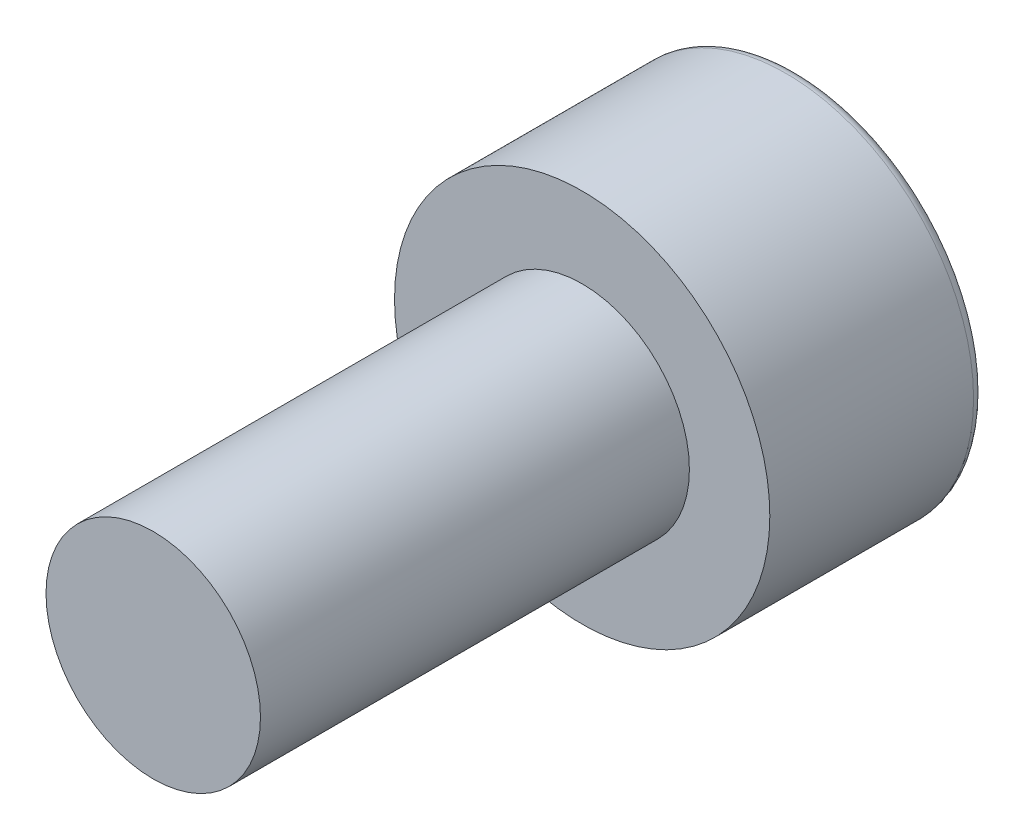
ISO-10303-21;
HEADER;
FILE_DESCRIPTION(('STEP AP214'),'2;1');
FILE_NAME('part.step','',(''),(''),'','','');
FILE_SCHEMA(('AUTOMOTIVE_DESIGN { 1 0 10303 214 1 1 1 1 }'));
ENDSEC;
DATA;
#1=APPLICATION_CONTEXT('core data for automotive mechanical design processes');
#2=APPLICATION_PROTOCOL_DEFINITION('international standard','automotive_design',2000,#1);
#3=PRODUCT_CONTEXT('',#1,'mechanical');
#4=PRODUCT('Part','Part','',(#3));
#5=PRODUCT_RELATED_PRODUCT_CATEGORY('part','',(#4));
#6=PRODUCT_DEFINITION_FORMATION('','',#4);
#7=PRODUCT_DEFINITION_CONTEXT('part definition',#1,'design');
#8=PRODUCT_DEFINITION('design','',#6,#7);
#9=PRODUCT_DEFINITION_SHAPE('','',#8);
#10=(LENGTH_UNIT() NAMED_UNIT(*) SI_UNIT(.MILLI.,.METRE.));
#11=(NAMED_UNIT(*) PLANE_ANGLE_UNIT() SI_UNIT($,.RADIAN.));
#12=(NAMED_UNIT(*) SI_UNIT($,.STERADIAN.) SOLID_ANGLE_UNIT());
#13=UNCERTAINTY_MEASURE_WITH_UNIT(LENGTH_MEASURE(1.E-05),#10,'distance_accuracy_value','');
#14=(GEOMETRIC_REPRESENTATION_CONTEXT(3) GLOBAL_UNCERTAINTY_ASSIGNED_CONTEXT((#13)) GLOBAL_UNIT_ASSIGNED_CONTEXT((#10,
#11,#12)) REPRESENTATION_CONTEXT('',''));
#15=CARTESIAN_POINT('',(0.,0.,0.));
#16=DIRECTION('',(0.,0.,1.));
#17=DIRECTION('',(1.,0.,0.));
#18=AXIS2_PLACEMENT_3D('',#15,#16,#17);
#19=CARTESIAN_POINT('',(0.,0.,8.));
#20=DIRECTION('',(0.,0.,-1.));
#21=DIRECTION('',(-1.,0.,0.));
#22=AXIS2_PLACEMENT_3D('',#19,#20,#21);
#23=CYLINDRICAL_SURFACE('',#22,2.);
#24=CARTESIAN_POINT('',(0.,0.,8.));
#25=DIRECTION('',(0.,0.,1.));
#26=DIRECTION('',(1.,0.,0.));
#27=AXIS2_PLACEMENT_3D('',#24,#25,#26);
#28=CIRCLE('',#27,2.);
#29=CARTESIAN_POINT('',(2.,0.,8.));
#30=VERTEX_POINT('',#29);
#31=EDGE_CURVE('E154',#30,#30,#28,.T.);
#32=ORIENTED_EDGE('',*,*,#31,.F.);
#33=EDGE_LOOP('',(#32));
#34=FACE_BOUND('',#33,.T.);
#35=CARTESIAN_POINT('',(0.,0.,0.));
#36=DIRECTION('',(0.,0.,1.));
#37=DIRECTION('',(1.,0.,0.));
#38=AXIS2_PLACEMENT_3D('',#35,#36,#37);
#39=CIRCLE('',#38,2.);
#40=CARTESIAN_POINT('',(2.,0.,0.));
#41=VERTEX_POINT('',#40);
#42=EDGE_CURVE('E151',#41,#41,#39,.T.);
#43=ORIENTED_EDGE('',*,*,#42,.T.);
#44=EDGE_LOOP('',(#43));
#45=FACE_BOUND('',#44,.T.);
#46=ADVANCED_FACE('F41',(#34,#45),#23,.T.);
#47=CARTESIAN_POINT('',(0.,0.,8.));
#48=DIRECTION('',(0.,0.,1.));
#49=DIRECTION('',(1.,0.,0.));
#50=AXIS2_PLACEMENT_3D('',#47,#48,#49);
#51=PLANE('',#50);
#52=ORIENTED_EDGE('',*,*,#31,.T.);
#53=EDGE_LOOP('',(#52));
#54=FACE_BOUND('',#53,.T.);
#55=ADVANCED_FACE('F172',(#54),#51,.T.);
#56=CARTESIAN_POINT('',(0.,0.,0.));
#57=DIRECTION('',(0.,0.,1.));
#58=DIRECTION('',(1.,0.,0.));
#59=AXIS2_PLACEMENT_3D('',#56,#57,#58);
#60=PLANE('',#59);
#61=CARTESIAN_POINT('',(0.,0.,0.));
#62=DIRECTION('',(0.,0.,1.));
#63=DIRECTION('',(1.,0.,0.));
#64=AXIS2_PLACEMENT_3D('',#61,#62,#63);
#65=CIRCLE('',#64,3.5);
#66=CARTESIAN_POINT('',(3.5,0.,0.));
#67=VERTEX_POINT('',#66);
#68=EDGE_CURVE('E143',#67,#67,#65,.T.);
#69=ORIENTED_EDGE('',*,*,#68,.T.);
#70=EDGE_LOOP('',(#69));
#71=FACE_BOUND('',#70,.T.);
#72=ORIENTED_EDGE('',*,*,#42,.F.);
#73=EDGE_LOOP('',(#72));
#74=FACE_BOUND('',#73,.T.);
#75=ADVANCED_FACE('F177',(#71,#74),#60,.T.);
#76=CARTESIAN_POINT('',(0.,0.,-4.));
#77=DIRECTION('',(0.,0.,1.));
#78=DIRECTION('',(1.,0.,0.));
#79=AXIS2_PLACEMENT_3D('',#76,#77,#78);
#80=CYLINDRICAL_SURFACE('',#79,3.5);
#81=CARTESIAN_POINT('',(0.,0.,-3.8));
#82=DIRECTION('',(0.,0.,1.));
#83=DIRECTION('',(1.,0.,0.));
#84=AXIS2_PLACEMENT_3D('',#81,#82,#83);
#85=CIRCLE('',#84,3.5);
#86=CARTESIAN_POINT('',(3.5,0.,-3.8));
#87=VERTEX_POINT('',#86);
#88=EDGE_CURVE('E49',#87,#87,#85,.T.);
#89=ORIENTED_EDGE('',*,*,#88,.T.);
#90=EDGE_LOOP('',(#89));
#91=FACE_BOUND('',#90,.T.);
#92=ORIENTED_EDGE('',*,*,#68,.F.);
#93=EDGE_LOOP('',(#92));
#94=FACE_BOUND('',#93,.T.);
#95=ADVANCED_FACE('F159',(#91,#94),#80,.T.);
#96=CARTESIAN_POINT('',(0.,0.,-4.));
#97=DIRECTION('',(0.,0.,1.));
#98=DIRECTION('',(1.,0.,0.));
#99=AXIS2_PLACEMENT_3D('',#96,#97,#98);
#100=PLANE('',#99);
#101=CARTESIAN_POINT('',(0.,0.,-4.));
#102=DIRECTION('',(0.,0.,1.));
#103=DIRECTION('',(1.,0.,0.));
#104=AXIS2_PLACEMENT_3D('',#101,#102,#103);
#105=CIRCLE('',#104,3.3);
#106=CARTESIAN_POINT('',(3.3,0.,-4.));
#107=VERTEX_POINT('',#106);
#108=EDGE_CURVE('E11',#107,#107,#105,.F.);
#109=ORIENTED_EDGE('',*,*,#108,.T.);
#110=EDGE_LOOP('',(#109));
#111=FACE_BOUND('',#110,.T.);
#112=DIRECTION('',(0.868434161422195,-0.495804505097451,0.));
#113=VECTOR('',#112,1.);
#114=CARTESIAN_POINT('',(0.,1.72,-4.));
#115=LINE('',#114,#113);
#116=CARTESIAN_POINT('',(0.,1.72,-4.));
#117=VERTEX_POINT('',#116);
#118=CARTESIAN_POINT('',(1.5,0.863623327267273,-4.));
#119=VERTEX_POINT('',#118);
#120=EDGE_CURVE('E130',#117,#119,#115,.T.);
#121=ORIENTED_EDGE('',*,*,#120,.F.);
#122=DIRECTION('',(0.868434161422195,0.495804505097451,0.));
#123=VECTOR('',#122,1.);
#124=CARTESIAN_POINT('',(-1.5,0.863623327267273,-4.));
#125=LINE('',#124,#123);
#126=CARTESIAN_POINT('',(-1.5,0.863623327267273,-4.));
#127=VERTEX_POINT('',#126);
#128=EDGE_CURVE('E56',#127,#117,#125,.T.);
#129=ORIENTED_EDGE('',*,*,#128,.F.);
#130=DIRECTION('',(0.,1.,0.));
#131=VECTOR('',#130,1.);
#132=CARTESIAN_POINT('',(-1.5,-0.863623327267273,-4.));
#133=LINE('',#132,#131);
#134=CARTESIAN_POINT('',(-1.5,-0.863623327267273,-4.));
#135=VERTEX_POINT('',#134);
#136=EDGE_CURVE('E139',#135,#127,#133,.T.);
#137=ORIENTED_EDGE('',*,*,#136,.F.);
#138=DIRECTION('',(-0.868434161422196,0.495804505097451,0.));
#139=VECTOR('',#138,1.);
#140=CARTESIAN_POINT('',(0.,-1.72,-4.));
#141=LINE('',#140,#139);
#142=CARTESIAN_POINT('',(0.,-1.72,-4.));
#143=VERTEX_POINT('',#142);
#144=EDGE_CURVE('E137',#143,#135,#141,.T.);
#145=ORIENTED_EDGE('',*,*,#144,.F.);
#146=DIRECTION('',(-0.868434161422196,-0.495804505097451,0.));
#147=VECTOR('',#146,1.);
#148=CARTESIAN_POINT('',(1.5,-0.863623327267272,-4.));
#149=LINE('',#148,#147);
#150=CARTESIAN_POINT('',(1.5,-0.863623327267272,-4.));
#151=VERTEX_POINT('',#150);
#152=EDGE_CURVE('E104',#151,#143,#149,.T.);
#153=ORIENTED_EDGE('',*,*,#152,.F.);
#154=DIRECTION('',(0.,-1.,0.));
#155=VECTOR('',#154,1.);
#156=CARTESIAN_POINT('',(1.5,0.863623327267273,-4.));
#157=LINE('',#156,#155);
#158=EDGE_CURVE('E133',#119,#151,#157,.T.);
#159=ORIENTED_EDGE('',*,*,#158,.F.);
#160=EDGE_LOOP('',(#121,#129,#137,#145,#153,#159));
#161=FACE_BOUND('',#160,.T.);
#162=ADVANCED_FACE('F185',(#111,#161),#100,.F.);
#163=CARTESIAN_POINT('',(-1.5,0.863623327267273,-2.));
#164=DIRECTION('',(-0.495804505097451,0.868434161422196,0.));
#165=DIRECTION('',(-0.868434161422195,-0.495804505097451,0.));
#166=AXIS2_PLACEMENT_3D('',#163,#164,#165);
#167=PLANE('',#166);
#168=ORIENTED_EDGE('',*,*,#128,.T.);
#169=DIRECTION('',(0.,0.,-1.));
#170=VECTOR('',#169,1.);
#171=CARTESIAN_POINT('',(0.,1.72,-2.));
#172=LINE('',#171,#170);
#173=CARTESIAN_POINT('',(0.,1.72,-2.));
#174=VERTEX_POINT('',#173);
#175=EDGE_CURVE('E86',#174,#117,#172,.T.);
#176=ORIENTED_EDGE('',*,*,#175,.F.);
#177=DIRECTION('',(0.868434161422195,0.495804505097451,0.));
#178=VECTOR('',#177,1.);
#179=CARTESIAN_POINT('',(-1.5,0.863623327267273,-2.));
#180=LINE('',#179,#178);
#181=CARTESIAN_POINT('',(-1.5,0.863623327267273,-2.));
#182=VERTEX_POINT('',#181);
#183=EDGE_CURVE('E141',#182,#174,#180,.T.);
#184=ORIENTED_EDGE('',*,*,#183,.F.);
#185=DIRECTION('',(0.,0.,-1.));
#186=VECTOR('',#185,1.);
#187=CARTESIAN_POINT('',(-1.5,0.863623327267273,-2.));
#188=LINE('',#187,#186);
#189=EDGE_CURVE('E64',#182,#127,#188,.T.);
#190=ORIENTED_EDGE('',*,*,#189,.T.);
#191=EDGE_LOOP('',(#168,#176,#184,#190));
#192=FACE_BOUND('',#191,.T.);
#193=ADVANCED_FACE('F190',(#192),#167,.F.);
#194=CARTESIAN_POINT('',(-1.5,-0.863623327267273,-2.));
#195=DIRECTION('',(-1.,0.,0.));
#196=DIRECTION('',(0.,0.,1.));
#197=AXIS2_PLACEMENT_3D('',#194,#195,#196);
#198=PLANE('',#197);
#199=ORIENTED_EDGE('',*,*,#136,.T.);
#200=ORIENTED_EDGE('',*,*,#189,.F.);
#201=DIRECTION('',(0.,1.,0.));
#202=VECTOR('',#201,1.);
#203=CARTESIAN_POINT('',(-1.5,-0.863623327267273,-2.));
#204=LINE('',#203,#202);
#205=CARTESIAN_POINT('',(-1.5,-0.863623327267273,-2.));
#206=VERTEX_POINT('',#205);
#207=EDGE_CURVE('E116',#206,#182,#204,.T.);
#208=ORIENTED_EDGE('',*,*,#207,.F.);
#209=DIRECTION('',(0.,0.,-1.));
#210=VECTOR('',#209,1.);
#211=CARTESIAN_POINT('',(-1.5,-0.863623327267273,-2.));
#212=LINE('',#211,#210);
#213=EDGE_CURVE('E108',#206,#135,#212,.T.);
#214=ORIENTED_EDGE('',*,*,#213,.T.);
#215=EDGE_LOOP('',(#199,#200,#208,#214));
#216=FACE_BOUND('',#215,.T.);
#217=ADVANCED_FACE('F194',(#216),#198,.F.);
#218=CARTESIAN_POINT('',(0.,-1.72,-2.));
#219=DIRECTION('',(-0.495804505097451,-0.868434161422196,0.));
#220=DIRECTION('',(0.868434161422196,-0.495804505097451,0.));
#221=AXIS2_PLACEMENT_3D('',#218,#219,#220);
#222=PLANE('',#221);
#223=ORIENTED_EDGE('',*,*,#144,.T.);
#224=ORIENTED_EDGE('',*,*,#213,.F.);
#225=DIRECTION('',(-0.868434161422196,0.495804505097451,0.));
#226=VECTOR('',#225,1.);
#227=CARTESIAN_POINT('',(0.,-1.72,-2.));
#228=LINE('',#227,#226);
#229=CARTESIAN_POINT('',(0.,-1.72,-2.));
#230=VERTEX_POINT('',#229);
#231=EDGE_CURVE('E112',#230,#206,#228,.T.);
#232=ORIENTED_EDGE('',*,*,#231,.F.);
#233=DIRECTION('',(0.,0.,-1.));
#234=VECTOR('',#233,1.);
#235=CARTESIAN_POINT('',(0.,-1.72,-2.));
#236=LINE('',#235,#234);
#237=EDGE_CURVE('E97',#230,#143,#236,.T.);
#238=ORIENTED_EDGE('',*,*,#237,.T.);
#239=EDGE_LOOP('',(#223,#224,#232,#238));
#240=FACE_BOUND('',#239,.T.);
#241=ADVANCED_FACE('F113',(#240),#222,.F.);
#242=CARTESIAN_POINT('',(1.5,-0.863623327267272,-2.));
#243=DIRECTION('',(0.495804505097451,-0.868434161422196,0.));
#244=DIRECTION('',(0.868434161422196,0.495804505097451,0.));
#245=AXIS2_PLACEMENT_3D('',#242,#243,#244);
#246=PLANE('',#245);
#247=ORIENTED_EDGE('',*,*,#152,.T.);
#248=ORIENTED_EDGE('',*,*,#237,.F.);
#249=DIRECTION('',(-0.868434161422196,-0.495804505097451,0.));
#250=VECTOR('',#249,1.);
#251=CARTESIAN_POINT('',(1.5,-0.863623327267272,-2.));
#252=LINE('',#251,#250);
#253=CARTESIAN_POINT('',(1.5,-0.863623327267272,-2.));
#254=VERTEX_POINT('',#253);
#255=EDGE_CURVE('E101',#254,#230,#252,.T.);
#256=ORIENTED_EDGE('',*,*,#255,.F.);
#257=DIRECTION('',(0.,0.,-1.));
#258=VECTOR('',#257,1.);
#259=CARTESIAN_POINT('',(1.5,-0.863623327267272,-2.));
#260=LINE('',#259,#258);
#261=EDGE_CURVE('E109',#254,#151,#260,.T.);
#262=ORIENTED_EDGE('',*,*,#261,.T.);
#263=EDGE_LOOP('',(#247,#248,#256,#262));
#264=FACE_BOUND('',#263,.T.);
#265=ADVANCED_FACE('F99',(#264),#246,.F.);
#266=CARTESIAN_POINT('',(1.5,0.863623327267273,-2.));
#267=DIRECTION('',(1.,0.,0.));
#268=DIRECTION('',(0.,0.,-1.));
#269=AXIS2_PLACEMENT_3D('',#266,#267,#268);
#270=PLANE('',#269);
#271=ORIENTED_EDGE('',*,*,#158,.T.);
#272=ORIENTED_EDGE('',*,*,#261,.F.);
#273=DIRECTION('',(0.,-1.,0.));
#274=VECTOR('',#273,1.);
#275=CARTESIAN_POINT('',(1.5,0.863623327267273,-2.));
#276=LINE('',#275,#274);
#277=CARTESIAN_POINT('',(1.5,0.863623327267273,-2.));
#278=VERTEX_POINT('',#277);
#279=EDGE_CURVE('E122',#278,#254,#276,.T.);
#280=ORIENTED_EDGE('',*,*,#279,.F.);
#281=DIRECTION('',(0.,0.,-1.));
#282=VECTOR('',#281,1.);
#283=CARTESIAN_POINT('',(1.5,0.863623327267273,-2.));
#284=LINE('',#283,#282);
#285=EDGE_CURVE('E146',#278,#119,#284,.T.);
#286=ORIENTED_EDGE('',*,*,#285,.T.);
#287=EDGE_LOOP('',(#271,#272,#280,#286));
#288=FACE_BOUND('',#287,.T.);
#289=ADVANCED_FACE('F197',(#288),#270,.F.);
#290=CARTESIAN_POINT('',(0.,1.72,-2.));
#291=DIRECTION('',(0.495804505097451,0.868434161422195,0.));
#292=DIRECTION('',(-0.868434161422195,0.495804505097451,0.));
#293=AXIS2_PLACEMENT_3D('',#290,#291,#292);
#294=PLANE('',#293);
#295=ORIENTED_EDGE('',*,*,#120,.T.);
#296=ORIENTED_EDGE('',*,*,#285,.F.);
#297=DIRECTION('',(0.868434161422195,-0.495804505097451,0.));
#298=VECTOR('',#297,1.);
#299=CARTESIAN_POINT('',(0.,1.72,-2.));
#300=LINE('',#299,#298);
#301=EDGE_CURVE('E124',#174,#278,#300,.T.);
#302=ORIENTED_EDGE('',*,*,#301,.F.);
#303=ORIENTED_EDGE('',*,*,#175,.T.);
#304=EDGE_LOOP('',(#295,#296,#302,#303));
#305=FACE_BOUND('',#304,.T.);
#306=ADVANCED_FACE('F168',(#305),#294,.F.);
#307=CARTESIAN_POINT('',(0.,0.,-2.));
#308=DIRECTION('',(0.,0.,-1.));
#309=DIRECTION('',(-1.,0.,0.));
#310=AXIS2_PLACEMENT_3D('',#307,#308,#309);
#311=PLANE('',#310);
#312=ORIENTED_EDGE('',*,*,#183,.T.);
#313=ORIENTED_EDGE('',*,*,#301,.T.);
#314=ORIENTED_EDGE('',*,*,#279,.T.);
#315=ORIENTED_EDGE('',*,*,#255,.T.);
#316=ORIENTED_EDGE('',*,*,#231,.T.);
#317=ORIENTED_EDGE('',*,*,#207,.T.);
#318=EDGE_LOOP('',(#312,#313,#314,#315,#316,#317));
#319=FACE_BOUND('',#318,.T.);
#320=ADVANCED_FACE('F119',(#319),#311,.T.);
#321=CARTESIAN_POINT('',(0.,0.,-3.8));
#322=DIRECTION('',(0.,0.,1.));
#323=DIRECTION('',(1.,0.,0.));
#324=AXIS2_PLACEMENT_3D('',#321,#322,#323);
#325=TOROIDAL_SURFACE('',#324,3.3,0.2);
#326=ORIENTED_EDGE('',*,*,#108,.F.);
#327=EDGE_LOOP('',(#326));
#328=FACE_BOUND('',#327,.T.);
#329=ORIENTED_EDGE('',*,*,#88,.F.);
#330=EDGE_LOOP('',(#329));
#331=FACE_BOUND('',#330,.T.);
#332=ADVANCED_FACE('F43',(#328,#331),#325,.T.);
#333=CLOSED_SHELL('',(#46,#55,#75,#95,#162,#193,#217,#241,#265,#289,#306,#320,#332));
#334=MANIFOLD_SOLID_BREP('B2',#333);
#335=ADVANCED_BREP_SHAPE_REPRESENTATION('',(#18,#334),#14);
#336=SHAPE_DEFINITION_REPRESENTATION(#9,#335);
ENDSEC;
END-ISO-10303-21;
